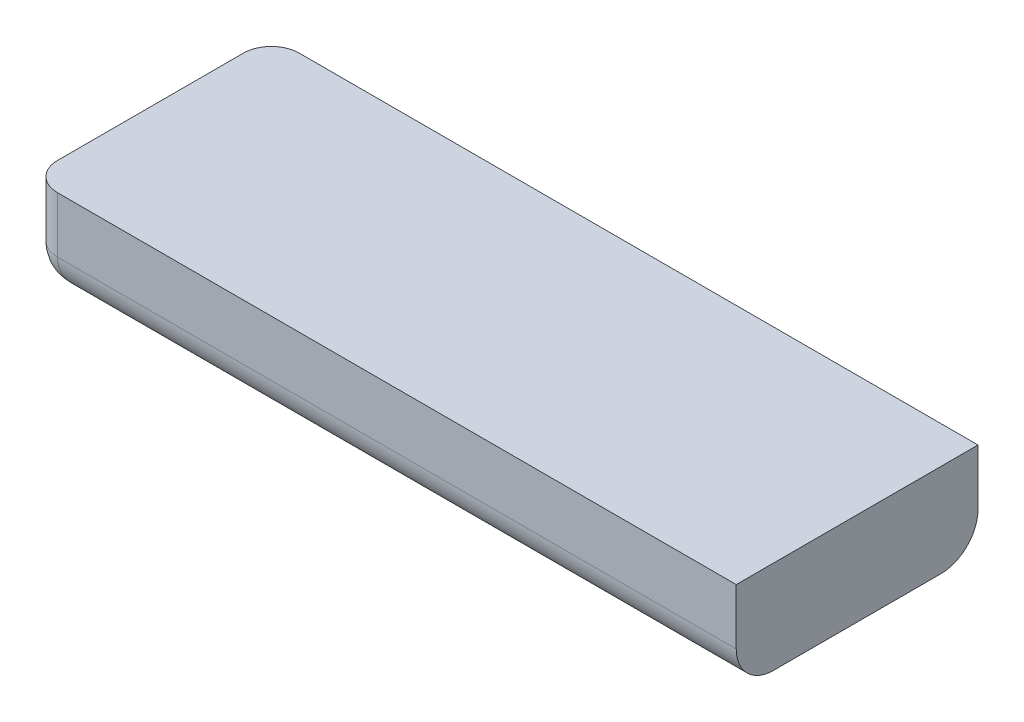
ISO-10303-21;
HEADER;
FILE_DESCRIPTION(('STEP AP214'),'2;1');
FILE_NAME('part.step','',(''),(''),'','','');
FILE_SCHEMA(('AUTOMOTIVE_DESIGN { 1 0 10303 214 1 1 1 1 }'));
ENDSEC;
DATA;
#1=APPLICATION_CONTEXT('core data for automotive mechanical design processes');
#2=APPLICATION_PROTOCOL_DEFINITION('international standard','automotive_design',2000,#1);
#3=PRODUCT_CONTEXT('',#1,'mechanical');
#4=PRODUCT('Part','Part','',(#3));
#5=PRODUCT_RELATED_PRODUCT_CATEGORY('part','',(#4));
#6=PRODUCT_DEFINITION_FORMATION('','',#4);
#7=PRODUCT_DEFINITION_CONTEXT('part definition',#1,'design');
#8=PRODUCT_DEFINITION('design','',#6,#7);
#9=PRODUCT_DEFINITION_SHAPE('','',#8);
#10=(LENGTH_UNIT() NAMED_UNIT(*) SI_UNIT(.MILLI.,.METRE.));
#11=(NAMED_UNIT(*) PLANE_ANGLE_UNIT() SI_UNIT($,.RADIAN.));
#12=(NAMED_UNIT(*) SI_UNIT($,.STERADIAN.) SOLID_ANGLE_UNIT());
#13=UNCERTAINTY_MEASURE_WITH_UNIT(LENGTH_MEASURE(1.E-05),#10,'distance_accuracy_value','');
#14=(GEOMETRIC_REPRESENTATION_CONTEXT(3) GLOBAL_UNCERTAINTY_ASSIGNED_CONTEXT((#13)) GLOBAL_UNIT_ASSIGNED_CONTEXT((#10,
#11,#12)) REPRESENTATION_CONTEXT('',''));
#15=CARTESIAN_POINT('',(0.,0.,0.));
#16=DIRECTION('',(0.,0.,1.));
#17=DIRECTION('',(1.,0.,0.));
#18=AXIS2_PLACEMENT_3D('',#15,#16,#17);
#19=CARTESIAN_POINT('',(-48.,0.,13.));
#20=DIRECTION('',(1.,0.,0.));
#21=DIRECTION('',(0.,0.,-1.));
#22=AXIS2_PLACEMENT_3D('',#19,#20,#21);
#23=PLANE('',#22);
#24=DIRECTION('',(0.,-1.,0.));
#25=VECTOR('',#24,1.);
#26=CARTESIAN_POINT('',(-48.,0.,1.5));
#27=LINE('',#26,#25);
#28=CARTESIAN_POINT('',(-48.,5.,1.5));
#29=VERTEX_POINT('',#28);
#30=CARTESIAN_POINT('',(-48.,2.,1.5));
#31=VERTEX_POINT('',#30);
#32=EDGE_CURVE('E143',#29,#31,#27,.T.);
#33=ORIENTED_EDGE('',*,*,#32,.T.);
#34=DIRECTION('',(0.,0.,-1.));
#35=VECTOR('',#34,1.);
#36=CARTESIAN_POINT('',(-48.,2.,13.));
#37=LINE('',#36,#35);
#38=CARTESIAN_POINT('',(-48.,2.,11.5));
#39=VERTEX_POINT('',#38);
#40=EDGE_CURVE('E11',#31,#39,#37,.F.);
#41=ORIENTED_EDGE('',*,*,#40,.T.);
#42=DIRECTION('',(0.,-1.,0.));
#43=VECTOR('',#42,1.);
#44=CARTESIAN_POINT('',(-48.,0.,11.5));
#45=LINE('',#44,#43);
#46=CARTESIAN_POINT('',(-48.,5.,11.5));
#47=VERTEX_POINT('',#46);
#48=EDGE_CURVE('E141',#39,#47,#45,.F.);
#49=ORIENTED_EDGE('',*,*,#48,.T.);
#50=DIRECTION('',(0.,0.,-1.));
#51=VECTOR('',#50,1.);
#52=CARTESIAN_POINT('',(-48.,5.,13.));
#53=LINE('',#52,#51);
#54=EDGE_CURVE('E126',#47,#29,#53,.T.);
#55=ORIENTED_EDGE('',*,*,#54,.T.);
#56=EDGE_LOOP('',(#33,#41,#49,#55));
#57=FACE_BOUND('',#56,.T.);
#58=ADVANCED_FACE('F37',(#57),#23,.F.);
#59=CARTESIAN_POINT('',(-48.,0.,13.));
#60=DIRECTION('',(0.,1.,0.));
#61=DIRECTION('',(0.,0.,1.));
#62=AXIS2_PLACEMENT_3D('',#59,#60,#61);
#63=PLANE('',#62);
#64=DIRECTION('',(0.,0.,-1.));
#65=VECTOR('',#64,1.);
#66=CARTESIAN_POINT('',(-10.,0.,13.));
#67=LINE('',#66,#65);
#68=CARTESIAN_POINT('',(-10.,0.,11.));
#69=VERTEX_POINT('',#68);
#70=CARTESIAN_POINT('',(-10.,0.,2.));
#71=VERTEX_POINT('',#70);
#72=EDGE_CURVE('E125',#69,#71,#67,.T.);
#73=ORIENTED_EDGE('',*,*,#72,.F.);
#74=DIRECTION('',(1.,0.,0.));
#75=VECTOR('',#74,1.);
#76=CARTESIAN_POINT('',(-48.,0.,11.));
#77=LINE('',#76,#75);
#78=CARTESIAN_POINT('',(-46.,0.,11.));
#79=VERTEX_POINT('',#78);
#80=EDGE_CURVE('E161',#69,#79,#77,.F.);
#81=ORIENTED_EDGE('',*,*,#80,.T.);
#82=DIRECTION('',(0.,0.,-1.));
#83=VECTOR('',#82,1.);
#84=CARTESIAN_POINT('',(-46.,0.,13.));
#85=LINE('',#84,#83);
#86=CARTESIAN_POINT('',(-46.,0.,2.));
#87=VERTEX_POINT('',#86);
#88=EDGE_CURVE('E157',#79,#87,#85,.T.);
#89=ORIENTED_EDGE('',*,*,#88,.T.);
#90=DIRECTION('',(1.,0.,0.));
#91=VECTOR('',#90,1.);
#92=CARTESIAN_POINT('',(-9.99999999999999,0.,2.));
#93=LINE('',#92,#91);
#94=EDGE_CURVE('E159',#87,#71,#93,.T.);
#95=ORIENTED_EDGE('',*,*,#94,.T.);
#96=EDGE_LOOP('',(#73,#81,#89,#95));
#97=FACE_BOUND('',#96,.T.);
#98=ADVANCED_FACE('F203',(#97),#63,.F.);
#99=CARTESIAN_POINT('',(-10.,0.,13.));
#100=DIRECTION('',(-1.,0.,0.));
#101=DIRECTION('',(0.,0.,1.));
#102=AXIS2_PLACEMENT_3D('',#99,#100,#101);
#103=PLANE('',#102);
#104=DIRECTION('',(0.,1.,0.));
#105=VECTOR('',#104,1.);
#106=CARTESIAN_POINT('',(-10.,0.,13.));
#107=LINE('',#106,#105);
#108=CARTESIAN_POINT('',(-10.,2.,13.));
#109=VERTEX_POINT('',#108);
#110=CARTESIAN_POINT('',(-10.,5.,13.));
#111=VERTEX_POINT('',#110);
#112=EDGE_CURVE('E106',#109,#111,#107,.T.);
#113=ORIENTED_EDGE('',*,*,#112,.F.);
#114=CARTESIAN_POINT('',(-10.,2.,11.));
#115=DIRECTION('',(-1.,0.,0.));
#116=DIRECTION('',(0.,0.,1.));
#117=AXIS2_PLACEMENT_3D('',#114,#115,#116);
#118=CIRCLE('',#117,2.);
#119=EDGE_CURVE('E155',#109,#69,#118,.F.);
#120=ORIENTED_EDGE('',*,*,#119,.T.);
#121=ORIENTED_EDGE('',*,*,#72,.T.);
#122=CARTESIAN_POINT('',(-9.99999999999999,2.,2.));
#123=DIRECTION('',(-1.,0.,0.));
#124=DIRECTION('',(0.,0.,1.));
#125=AXIS2_PLACEMENT_3D('',#122,#123,#124);
#126=CIRCLE('',#125,2.);
#127=CARTESIAN_POINT('',(-10.,2.,0.));
#128=VERTEX_POINT('',#127);
#129=EDGE_CURVE('E153',#71,#128,#126,.F.);
#130=ORIENTED_EDGE('',*,*,#129,.T.);
#131=DIRECTION('',(0.,1.,0.));
#132=VECTOR('',#131,1.);
#133=CARTESIAN_POINT('',(-10.,0.,0.));
#134=LINE('',#133,#132);
#135=CARTESIAN_POINT('',(-10.,5.,0.));
#136=VERTEX_POINT('',#135);
#137=EDGE_CURVE('E121',#128,#136,#134,.T.);
#138=ORIENTED_EDGE('',*,*,#137,.T.);
#139=DIRECTION('',(0.,0.,-1.));
#140=VECTOR('',#139,1.);
#141=CARTESIAN_POINT('',(-10.,5.,13.));
#142=LINE('',#141,#140);
#143=EDGE_CURVE('E119',#111,#136,#142,.T.);
#144=ORIENTED_EDGE('',*,*,#143,.F.);
#145=EDGE_LOOP('',(#113,#120,#121,#130,#138,#144));
#146=FACE_BOUND('',#145,.T.);
#147=ADVANCED_FACE('F120',(#146),#103,.F.);
#148=CARTESIAN_POINT('',(-48.,5.,13.));
#149=DIRECTION('',(0.,-1.,0.));
#150=DIRECTION('',(0.,0.,-1.));
#151=AXIS2_PLACEMENT_3D('',#148,#149,#150);
#152=PLANE('',#151);
#153=DIRECTION('',(-1.,0.,0.));
#154=VECTOR('',#153,1.);
#155=CARTESIAN_POINT('',(-48.,5.,0.));
#156=LINE('',#155,#154);
#157=CARTESIAN_POINT('',(-46.5,5.,0.));
#158=VERTEX_POINT('',#157);
#159=EDGE_CURVE('E116',#136,#158,#156,.T.);
#160=ORIENTED_EDGE('',*,*,#159,.T.);
#161=CARTESIAN_POINT('',(-46.5,5.,1.5));
#162=DIRECTION('',(0.,-1.,0.));
#163=DIRECTION('',(0.,0.,-1.));
#164=AXIS2_PLACEMENT_3D('',#161,#162,#163);
#165=CIRCLE('',#164,1.5);
#166=EDGE_CURVE('E148',#158,#29,#165,.F.);
#167=ORIENTED_EDGE('',*,*,#166,.T.);
#168=ORIENTED_EDGE('',*,*,#54,.F.);
#169=CARTESIAN_POINT('',(-46.5,5.,11.5));
#170=DIRECTION('',(0.,-1.,0.));
#171=DIRECTION('',(0.,0.,-1.));
#172=AXIS2_PLACEMENT_3D('',#169,#170,#171);
#173=CIRCLE('',#172,1.5);
#174=CARTESIAN_POINT('',(-46.5,5.,13.));
#175=VERTEX_POINT('',#174);
#176=EDGE_CURVE('E131',#47,#175,#173,.F.);
#177=ORIENTED_EDGE('',*,*,#176,.T.);
#178=DIRECTION('',(-1.,0.,0.));
#179=VECTOR('',#178,1.);
#180=CARTESIAN_POINT('',(-48.,5.,13.));
#181=LINE('',#180,#179);
#182=EDGE_CURVE('E111',#111,#175,#181,.T.);
#183=ORIENTED_EDGE('',*,*,#182,.F.);
#184=ORIENTED_EDGE('',*,*,#143,.T.);
#185=EDGE_LOOP('',(#160,#167,#168,#177,#183,#184));
#186=FACE_BOUND('',#185,.T.);
#187=ADVANCED_FACE('F128',(#186),#152,.F.);
#188=CARTESIAN_POINT('',(0.,0.,13.));
#189=DIRECTION('',(0.,0.,-1.));
#190=DIRECTION('',(-1.,0.,0.));
#191=AXIS2_PLACEMENT_3D('',#188,#189,#190);
#192=PLANE('',#191);
#193=DIRECTION('',(0.,-1.,0.));
#194=VECTOR('',#193,1.);
#195=CARTESIAN_POINT('',(-46.5,0.,13.));
#196=LINE('',#195,#194);
#197=CARTESIAN_POINT('',(-46.5,2.,13.));
#198=VERTEX_POINT('',#197);
#199=EDGE_CURVE('E150',#175,#198,#196,.T.);
#200=ORIENTED_EDGE('',*,*,#199,.T.);
#201=DIRECTION('',(1.,0.,0.));
#202=VECTOR('',#201,1.);
#203=CARTESIAN_POINT('',(0.,2.,13.));
#204=LINE('',#203,#202);
#205=EDGE_CURVE('E114',#198,#109,#204,.T.);
#206=ORIENTED_EDGE('',*,*,#205,.T.);
#207=ORIENTED_EDGE('',*,*,#112,.T.);
#208=ORIENTED_EDGE('',*,*,#182,.T.);
#209=EDGE_LOOP('',(#200,#206,#207,#208));
#210=FACE_BOUND('',#209,.T.);
#211=ADVANCED_FACE('F109',(#210),#192,.F.);
#212=CARTESIAN_POINT('',(0.,0.,0.));
#213=DIRECTION('',(0.,0.,-1.));
#214=DIRECTION('',(-1.,0.,0.));
#215=AXIS2_PLACEMENT_3D('',#212,#213,#214);
#216=PLANE('',#215);
#217=ORIENTED_EDGE('',*,*,#137,.F.);
#218=DIRECTION('',(1.,0.,0.));
#219=VECTOR('',#218,1.);
#220=CARTESIAN_POINT('',(-46.5,2.,0.));
#221=LINE('',#220,#219);
#222=CARTESIAN_POINT('',(-46.5,2.,0.));
#223=VERTEX_POINT('',#222);
#224=EDGE_CURVE('E62',#128,#223,#221,.F.);
#225=ORIENTED_EDGE('',*,*,#224,.T.);
#226=DIRECTION('',(0.,-1.,0.));
#227=VECTOR('',#226,1.);
#228=CARTESIAN_POINT('',(-46.5,5.,0.));
#229=LINE('',#228,#227);
#230=EDGE_CURVE('E145',#223,#158,#229,.F.);
#231=ORIENTED_EDGE('',*,*,#230,.T.);
#232=ORIENTED_EDGE('',*,*,#159,.F.);
#233=EDGE_LOOP('',(#217,#225,#231,#232));
#234=FACE_BOUND('',#233,.T.);
#235=ADVANCED_FACE('F215',(#234),#216,.T.);
#236=CARTESIAN_POINT('',(-46.5,0.,1.5));
#237=DIRECTION('',(0.,1.,0.));
#238=DIRECTION('',(0.,0.,1.));
#239=AXIS2_PLACEMENT_3D('',#236,#237,#238);
#240=CYLINDRICAL_SURFACE('',#239,1.5);
#241=ORIENTED_EDGE('',*,*,#230,.F.);
#242=CARTESIAN_POINT('',(-46.5,2.,1.5));
#243=DIRECTION('',(0.,1.,0.));
#244=DIRECTION('',(0.,0.,1.));
#245=AXIS2_PLACEMENT_3D('',#242,#243,#244);
#246=CIRCLE('',#245,1.5);
#247=EDGE_CURVE('E47',#223,#31,#246,.T.);
#248=ORIENTED_EDGE('',*,*,#247,.T.);
#249=ORIENTED_EDGE('',*,*,#32,.F.);
#250=ORIENTED_EDGE('',*,*,#166,.F.);
#251=EDGE_LOOP('',(#241,#248,#249,#250));
#252=FACE_BOUND('',#251,.T.);
#253=ADVANCED_FACE('F213',(#252),#240,.T.);
#254=CARTESIAN_POINT('',(-46.5,0.,11.5));
#255=DIRECTION('',(0.,-1.,0.));
#256=DIRECTION('',(0.,0.,-1.));
#257=AXIS2_PLACEMENT_3D('',#254,#255,#256);
#258=CYLINDRICAL_SURFACE('',#257,1.5);
#259=ORIENTED_EDGE('',*,*,#48,.F.);
#260=CARTESIAN_POINT('',(-46.5,2.,11.5));
#261=DIRECTION('',(0.,1.,0.));
#262=DIRECTION('',(0.,0.,1.));
#263=AXIS2_PLACEMENT_3D('',#260,#261,#262);
#264=CIRCLE('',#263,1.5);
#265=EDGE_CURVE('E163',#39,#198,#264,.T.);
#266=ORIENTED_EDGE('',*,*,#265,.T.);
#267=ORIENTED_EDGE('',*,*,#199,.F.);
#268=ORIENTED_EDGE('',*,*,#176,.F.);
#269=EDGE_LOOP('',(#259,#266,#267,#268));
#270=FACE_BOUND('',#269,.T.);
#271=ADVANCED_FACE('F200',(#270),#258,.T.);
#272=CARTESIAN_POINT('',(-48.,2.,2.));
#273=DIRECTION('',(-1.,0.,0.));
#274=DIRECTION('',(0.,0.,1.));
#275=AXIS2_PLACEMENT_3D('',#272,#273,#274);
#276=CYLINDRICAL_SURFACE('',#275,2.);
#277=ORIENTED_EDGE('',*,*,#129,.F.);
#278=ORIENTED_EDGE('',*,*,#94,.F.);
#279=CARTESIAN_POINT('',(-46.,2.,2.));
#280=DIRECTION('',(0.970142500145332,0.,-0.242535625036333));
#281=DIRECTION('',(-0.242535625036333,0.,-0.970142500145332));
#282=AXIS2_PLACEMENT_3D('',#279,#280,#281);
#283=ELLIPSE('',#282,2.06155281280883,2.);
#284=EDGE_CURVE('E137',#223,#87,#283,.F.);
#285=ORIENTED_EDGE('',*,*,#284,.F.);
#286=ORIENTED_EDGE('',*,*,#224,.F.);
#287=EDGE_LOOP('',(#277,#278,#285,#286));
#288=FACE_BOUND('',#287,.T.);
#289=ADVANCED_FACE('F39',(#288),#276,.T.);
#290=CARTESIAN_POINT('',(-46.,4.,2.));
#291=CARTESIAN_POINT('',(-46.,4.,2.));
#292=CARTESIAN_POINT('',(-46.,4.,2.));
#293=CARTESIAN_POINT('',(-46.0217823735519,3.99996494474998,1.9128705057924));
#294=CARTESIAN_POINT('',(-46.0544658990014,3.99993095316826,1.9455341009986));
#295=CARTESIAN_POINT('',(-46.0871294942076,3.99996494474999,1.9782176264481));
#296=CARTESIAN_POINT('',(-46.0435703088954,3.99430351256916,1.82571876441834));
#297=CARTESIAN_POINT('',(-46.1090831888134,3.99856983476416,1.89091681118662));
#298=CARTESIAN_POINT('',(-46.1742812355816,3.99430351256916,1.95642969110459));
#299=CARTESIAN_POINT('',(-46.0867714969681,3.9715729489111,1.65291401212763));
#300=CARTESIAN_POINT('',(-46.2187583926554,3.99277254732977,1.78124160734456));
#301=CARTESIAN_POINT('',(-46.3470859878724,3.9715729489111,1.91322850303191));
#302=CARTESIAN_POINT('',(-46.1081863603207,3.95460119067819,1.56725455871726));
#303=CARTESIAN_POINT('',(-46.274125241757,3.98832872132925,1.72587475824302));
#304=CARTESIAN_POINT('',(-46.4327454412828,3.95460119067819,1.89181363967932));
#305=CARTESIAN_POINT('',(-46.1502767096491,3.90948369144371,1.39889316140363));
#306=CARTESIAN_POINT('',(-46.3860602594996,3.97583045239163,1.61393974050036));
#307=CARTESIAN_POINT('',(-46.6011068385964,3.90948369144371,1.84972329035091));
#308=CARTESIAN_POINT('',(-46.1709585724816,3.88153014584449,1.31616571007354));
#309=CARTESIAN_POINT('',(-46.4429333103374,3.96776150811199,1.55706668966255));
#310=CARTESIAN_POINT('',(-46.6838342899265,3.88153014584449,1.82904142751839));
#311=CARTESIAN_POINT('',(-46.2112227334933,3.81481991430687,1.15510906602663));
#312=CARTESIAN_POINT('',(-46.5586469433439,3.94682689780725,1.4413530566561));
#313=CARTESIAN_POINT('',(-46.8448909339734,3.81481991430687,1.78877726650666));
#314=CARTESIAN_POINT('',(-46.2308195679233,3.77634632088565,1.07672172830669));
#315=CARTESIAN_POINT('',(-46.6177814364256,3.93394473948205,1.38221856357442));
#316=CARTESIAN_POINT('',(-46.9232782716933,3.77634632088565,1.76918043207667));
#317=CARTESIAN_POINT('',(-46.26856991767,3.68916522333628,0.925720329320102));
#318=CARTESIAN_POINT('',(-46.7387097314489,3.90148554453111,1.26129026855111));
#319=CARTESIAN_POINT('',(-47.0742796706799,3.68916522333628,1.73143008233003));
#320=CARTESIAN_POINT('',(-46.2867495193356,3.64082244489378,0.85300192265774));
#321=CARTESIAN_POINT('',(-46.8007763341728,3.88189914028463,1.19922366582722));
#322=CARTESIAN_POINT('',(-47.1469980773423,3.64082244489378,1.71325048066444));
#323=CARTESIAN_POINT('',(-46.3213420383227,3.53464696521005,0.714631846709061));
#324=CARTESIAN_POINT('',(-46.9279910465151,3.83314574012919,1.07200895348487));
#325=CARTESIAN_POINT('',(-47.2853681532909,3.53464696521006,1.67865796167727));
#326=CARTESIAN_POINT('',(-46.3377958358128,3.47724460284421,0.648816656748729));
#327=CARTESIAN_POINT('',(-46.9933740400537,3.80399573458142,1.00662595994632));
#328=CARTESIAN_POINT('',(-47.3511833432513,3.47724460284421,1.66220416418718));
#329=CARTESIAN_POINT('',(-46.3686396401377,3.35386777783721,0.525441439449086));
#330=CARTESIAN_POINT('',(-47.12698019571,3.73205835147552,0.87301980429005));
#331=CARTESIAN_POINT('',(-47.4745585605509,3.35386777783721,1.63136035986227));
#332=CARTESIAN_POINT('',(-46.383087706164,3.28836268671713,0.46764917534402));
#333=CARTESIAN_POINT('',(-47.1953761618153,3.68935068106379,0.804623838184725));
#334=CARTESIAN_POINT('',(-47.532350824656,3.28836268671713,1.61691229383601));
#335=CARTESIAN_POINT('',(-46.4096548366656,3.14986714163205,0.36138065333758));
#336=CARTESIAN_POINT('',(-47.3334466924501,3.58516450268843,0.666553307549958));
#337=CARTESIAN_POINT('',(-47.6386193466624,3.14986714163204,1.5903451633344));
#338=CARTESIAN_POINT('',(-46.4218493954006,3.07734548187638,0.312602418397777));
#339=CARTESIAN_POINT('',(-47.4032025242226,3.52389206574663,0.596797475777379));
#340=CARTESIAN_POINT('',(-47.6873975816022,3.07734548187638,1.57815060459944));
#341=CARTESIAN_POINT('',(-46.4436829907165,2.92607041368136,0.225268037133861));
#342=CARTESIAN_POINT('',(-47.5402611598715,3.37720248612513,0.459738840128498));
#343=CARTESIAN_POINT('',(-47.7747319628661,2.92607041368136,1.55631700928347));
#344=CARTESIAN_POINT('',(-46.4534111045777,2.84773367629154,0.186355581689056));
#345=CARTESIAN_POINT('',(-47.6075290720318,3.29221621118452,0.392470927968151));
#346=CARTESIAN_POINT('',(-47.8136444183109,2.84773367629154,1.54658889542226));
#347=CARTESIAN_POINT('',(-46.4701326318778,2.68624305324206,0.119469472488753));
#348=CARTESIAN_POINT('',(-47.7331106365313,3.09457190601744,0.266889363468725));
#349=CARTESIAN_POINT('',(-47.8805305275112,2.68624305324206,1.52986736812219));
#350=CARTESIAN_POINT('',(-46.4772186371533,2.60340026957908,0.0911254513869064));
#351=CARTESIAN_POINT('',(-47.7912758499544,2.98269208037831,0.208724150045587));
#352=CARTESIAN_POINT('',(-47.9088745486131,2.60340026957908,1.52278136284673));
#353=CARTESIAN_POINT('',(-46.4885347087233,2.43445104755719,0.0458611651065924));
#354=CARTESIAN_POINT('',(-47.8900061070333,2.73279669472578,0.109993892966676));
#355=CARTESIAN_POINT('',(-47.9541388348934,2.43445104755719,1.51146529127665));
#356=CARTESIAN_POINT('',(-46.492844140155,2.34851729547956,0.0286234393801281));
#357=CARTESIAN_POINT('',(-47.9303663463236,2.59599834502849,0.0696336536764172));
#358=CARTESIAN_POINT('',(-47.9713765606199,2.34851729547956,1.50715585984503));
#359=CARTESIAN_POINT('',(-46.4985534982464,2.1750224755448,0.00578600701445321));
#360=CARTESIAN_POINT('',(-47.9854388494596,2.30535282110524,0.0145611505404173));
#361=CARTESIAN_POINT('',(-47.9942139929856,2.1750224755448,1.50144650175361));
#362=CARTESIAN_POINT('',(-46.5,2.0875112377724,0.));
#363=CARTESIAN_POINT('',(-48.,2.15312193493139,0.));
#364=CARTESIAN_POINT('',(-48.,2.0875112377724,1.5));
#365=CARTESIAN_POINT('',(-46.5,1.9124887622276,0.));
#366=CARTESIAN_POINT('',(-48.,1.84687806506861,0.));
#367=CARTESIAN_POINT('',(-48.,1.9124887622276,1.5));
#368=CARTESIAN_POINT('',(-46.4985534982464,1.82497752445519,0.0057860070144531));
#369=CARTESIAN_POINT('',(-47.9854388494596,1.69464717889476,0.0145611505404174));
#370=CARTESIAN_POINT('',(-47.9942139929856,1.82497752445519,1.50144650175361));
#371=CARTESIAN_POINT('',(-46.492844140155,1.65148270452044,0.028623439380128));
#372=CARTESIAN_POINT('',(-47.9303663463236,1.40400165497151,0.0696336536764171));
#373=CARTESIAN_POINT('',(-47.9713765606199,1.65148270452044,1.50715585984503));
#374=CARTESIAN_POINT('',(-46.4885347087233,1.56554895244281,0.0458611651065922));
#375=CARTESIAN_POINT('',(-47.8900061070333,1.26720330527422,0.109993892966675));
#376=CARTESIAN_POINT('',(-47.9541388348934,1.56554895244281,1.51146529127665));
#377=CARTESIAN_POINT('',(-46.4772186371533,1.39659973042092,0.0911254513869063));
#378=CARTESIAN_POINT('',(-47.7912758499544,1.01730791962169,0.208724150045585));
#379=CARTESIAN_POINT('',(-47.9088745486131,1.39659973042092,1.52278136284673));
#380=CARTESIAN_POINT('',(-46.4701326318778,1.31375694675793,0.119469472488754));
#381=CARTESIAN_POINT('',(-47.7331106365313,0.905428093982555,0.266889363468725));
#382=CARTESIAN_POINT('',(-47.8805305275112,1.31375694675793,1.52986736812219));
#383=CARTESIAN_POINT('',(-46.4534111045777,1.15226632370846,0.186355581689057));
#384=CARTESIAN_POINT('',(-47.6075290720318,0.707783788815476,0.392470927968151));
#385=CARTESIAN_POINT('',(-47.8136444183109,1.15226632370846,1.54658889542226));
#386=CARTESIAN_POINT('',(-46.4436829907165,1.07392958631864,0.225268037133861));
#387=CARTESIAN_POINT('',(-47.5402611598715,0.622797513874873,0.459738840128498));
#388=CARTESIAN_POINT('',(-47.7747319628661,1.07392958631864,1.55631700928347));
#389=CARTESIAN_POINT('',(-46.4218493954006,0.922654518123616,0.312602418397776));
#390=CARTESIAN_POINT('',(-47.4032025242226,0.476107934253368,0.596797475777378));
#391=CARTESIAN_POINT('',(-47.6873975816022,0.92265451812362,1.57815060459944));
#392=CARTESIAN_POINT('',(-46.4096548366656,0.850132858367954,0.361380653337579));
#393=CARTESIAN_POINT('',(-47.33344669245,0.414835497311566,0.666553307549957));
#394=CARTESIAN_POINT('',(-47.6386193466624,0.850132858367957,1.59034516333439));
#395=CARTESIAN_POINT('',(-46.383087706164,0.711637313282867,0.467649175344019));
#396=CARTESIAN_POINT('',(-47.1953761618153,0.310649318936207,0.804623838184724));
#397=CARTESIAN_POINT('',(-47.532350824656,0.711637313282866,1.616912293836));
#398=CARTESIAN_POINT('',(-46.3686396401377,0.646132222162793,0.525441439449085));
#399=CARTESIAN_POINT('',(-47.1269801957099,0.267941648524485,0.873019804290049));
#400=CARTESIAN_POINT('',(-47.4745585605509,0.646132222162791,1.63136035986227));
#401=CARTESIAN_POINT('',(-46.3377958358128,0.522755397155792,0.648816656748728));
#402=CARTESIAN_POINT('',(-46.9933740400537,0.196004265418576,1.00662595994632));
#403=CARTESIAN_POINT('',(-47.3511833432513,0.522755397155788,1.66220416418718));
#404=CARTESIAN_POINT('',(-46.3213420383227,0.465353034789947,0.71463184670906));
#405=CARTESIAN_POINT('',(-46.9279910465151,0.166854259870814,1.07200895348487));
#406=CARTESIAN_POINT('',(-47.2853681532909,0.465353034789942,1.67865796167726));
#407=CARTESIAN_POINT('',(-46.2867495193356,0.359177555106218,0.853001922657739));
#408=CARTESIAN_POINT('',(-46.8007763341728,0.11810085971537,1.19922366582722));
#409=CARTESIAN_POINT('',(-47.1469980773423,0.359177555106215,1.71325048066443));
#410=CARTESIAN_POINT('',(-46.26856991767,0.310834776663722,0.925720329320102));
#411=CARTESIAN_POINT('',(-46.7387097314489,0.0985144554688906,1.26129026855111));
#412=CARTESIAN_POINT('',(-47.0742796706799,0.310834776663723,1.73143008233003));
#413=CARTESIAN_POINT('',(-46.2308195679233,0.223653679114346,1.07672172830669));
#414=CARTESIAN_POINT('',(-46.6177814364256,0.0660552605179474,1.38221856357442));
#415=CARTESIAN_POINT('',(-46.9232782716933,0.223653679114346,1.76918043207667));
#416=CARTESIAN_POINT('',(-46.2112227334933,0.185180085693135,1.15510906602663));
#417=CARTESIAN_POINT('',(-46.5586469433439,0.0531731021927445,1.4413530566561));
#418=CARTESIAN_POINT('',(-46.8448909339734,0.18518008569313,1.78877726650666));
#419=CARTESIAN_POINT('',(-46.1709585724816,0.11846985415551,1.31616571007354));
#420=CARTESIAN_POINT('',(-46.4429333103374,0.0322384918880124,1.55706668966255));
#421=CARTESIAN_POINT('',(-46.6838342899265,0.118469854155506,1.82904142751839));
#422=CARTESIAN_POINT('',(-46.1502767096491,0.0905163085562906,1.39889316140363));
#423=CARTESIAN_POINT('',(-46.3860602594996,0.0241695476083737,1.61393974050036));
#424=CARTESIAN_POINT('',(-46.6011068385964,0.090516308556292,1.84972329035091));
#425=CARTESIAN_POINT('',(-46.1081863603207,0.0453988093218062,1.56725455871726));
#426=CARTESIAN_POINT('',(-46.274125241757,0.0116712786707473,1.72587475824302));
#427=CARTESIAN_POINT('',(-46.4327454412828,0.0453988093218109,1.89181363967932));
#428=CARTESIAN_POINT('',(-46.0867714969681,0.0284270510888973,1.65291401212763));
#429=CARTESIAN_POINT('',(-46.2187583926554,0.00722745267022655,1.78124160734456));
#430=CARTESIAN_POINT('',(-46.3470859878724,0.0284270510888994,1.91322850303191));
#431=CARTESIAN_POINT('',(-46.0435703088954,0.00569648743083564,1.82571876441834));
#432=CARTESIAN_POINT('',(-46.1090831888134,0.00143016523584192,1.89091681118662));
#433=CARTESIAN_POINT('',(-46.1742812355816,0.00569648743083349,1.95642969110458));
#434=CARTESIAN_POINT('',(-46.0217823735519,3.50552500160527E-05,1.9128705057924));
#435=CARTESIAN_POINT('',(-46.0544658990014,6.90468317338841E-05,1.9455341009986));
#436=CARTESIAN_POINT('',(-46.0871294942076,3.50552500122641E-05,1.9782176264481));
#437=CARTESIAN_POINT('',(-46.,0.,2.));
#438=CARTESIAN_POINT('',(-46.,0.,2.));
#439=CARTESIAN_POINT('',(-46.,0.,2.));
#440=(BOUNDED_SURFACE() B_SPLINE_SURFACE(3,2,((#290,#291,#292),(#293,#294,#295),(#296,#297,
#298),(#299,#300,#301),(#302,#303,#304),(#305,#306,#307),(#308,#309,#310),(#311,#312,#313),
(#314,#315,#316),(#317,#318,#319),(#320,#321,#322),(#323,#324,#325),(#326,#327,#328),(#329,#330,
#331),(#332,#333,#334),(#335,#336,#337),(#338,#339,#340),(#341,#342,#343),(#344,#345,#346),
(#347,#348,#349),(#350,#351,#352),(#353,#354,#355),(#356,#357,#358),(#359,#360,#361),(#362,#363,
#364),(#365,#366,#367),(#368,#369,#370),(#371,#372,#373),(#374,#375,#376),(#377,#378,#379),
(#380,#381,#382),(#383,#384,#385),(#386,#387,#388),(#389,#390,#391),(#392,#393,#394),(#395,#396,
#397),(#398,#399,#400),(#401,#402,#403),(#404,#405,#406),(#407,#408,#409),(#410,#411,#412),
(#413,#414,#415),(#416,#417,#418),(#419,#420,#421),(#422,#423,#424),(#425,#426,#427),(#428,#429,
#430),(#431,#432,#433),(#434,#435,#436),(#437,#438,#439)),.UNSPECIFIED.,.F.,.F.,
.F.) B_SPLINE_SURFACE_WITH_KNOTS((4,2,2,2,2,2,2,2,2,2,2,2,2,2,2,2,2,2,2,2,2,2,2,2,4),(3,3),(0.,
0.0923950270683505,0.184004706351033,0.274077820658671,0.361932038391825,0.446989850632085,
0.528816016293443,0.607156213845176,0.681975172112349,0.753489816527185,0.822188739504235,
0.888824875354154,0.954367738522642,1.01991060169113,1.08654673754105,1.1552456605181,
1.22676030493293,1.30157926320011,1.37991946075184,1.4617456264132,1.54680343865346,
1.63465765638661,1.72473077069425,1.81634044997693,1.90873547704528),(0.,1.),
.UNSPECIFIED.) GEOMETRIC_REPRESENTATION_ITEM() RATIONAL_B_SPLINE_SURFACE(((1.,1.,1.),(1.,
1.00000566557019,1.),(1.,0.998576699090688,1.),(1.,0.992910721279765,1.),(1.,0.988697681267574,
1.),(1.,0.977617128833049,1.),(1.,0.970795325018433,1.),(1.,0.954789124900482,1.),(1.,
0.945667069465631,1.),(1.,0.92548796875733,1.),(1.,0.914501756375307,1.),(1.,0.891169998194025,
1.),(1.,0.878891956959709,1.),(1.,0.853706993048538,1.),(1.,0.84084914596985,1.),(1.,
0.815387454422431,1.),(1.,0.802798170091792,1.),(1.,0.778880732263429,1.),(1.,0.767521437046521,
1.),(1.,0.747118526989835,1.),(1.,0.738001346912332,1.),(1.,0.723039691293395,1.),(1.,
0.717105167896984,1.),(1.,0.709170186451793,1.),(1.,0.707106781186548,1.),(1.,0.707106781186548,
1.),(1.,0.709170186451793,1.),(1.,0.717105167896984,1.),(1.,0.723039691293395,1.),(1.,
0.738001346912332,1.),(1.,0.747118526989835,1.),(1.,0.767521437046521,1.),(1.,0.778880732263429,
1.),(1.,0.802798170091791,1.),(1.,0.81538745442243,1.),(1.,0.84084914596985,1.),(1.,
0.853706993048538,1.),(1.,0.878891956959709,1.),(1.,0.891169998194025,1.),(1.,0.914501756375307,
1.),(1.,0.92548796875733,1.),(1.,0.945667069465631,1.),(1.,0.954789124900482,1.),(1.,
0.970795325018433,1.),(1.,0.977617128833049,1.),(1.,0.988697681267574,1.),(1.,0.992910721279765,
1.),(1.,0.998576699090688,1.),(1.,1.00000566557019,1.),(1.,1.,1.))) REPRESENTATION_ITEM('') SURFACE());
#441=ORIENTED_EDGE('',*,*,#247,.F.);
#442=ORIENTED_EDGE('',*,*,#284,.T.);
#443=CARTESIAN_POINT('',(-46.,2.,2.));
#444=DIRECTION('',(0.242535625036332,0.,-0.970142500145332));
#445=DIRECTION('',(-0.970142500145332,0.,-0.242535625036332));
#446=AXIS2_PLACEMENT_3D('',#443,#444,#445);
#447=ELLIPSE('',#446,2.06155281280883,2.);
#448=EDGE_CURVE('E173',#31,#87,#447,.F.);
#449=ORIENTED_EDGE('',*,*,#448,.F.);
#450=EDGE_LOOP('',(#441,#442,#449));
#451=FACE_BOUND('',#450,.T.);
#452=ADVANCED_FACE('F190',(#451),#440,.T.);
#453=CARTESIAN_POINT('',(-46.,2.,13.));
#454=DIRECTION('',(0.,0.,-1.));
#455=DIRECTION('',(-1.,0.,0.));
#456=AXIS2_PLACEMENT_3D('',#453,#454,#455);
#457=CYLINDRICAL_SURFACE('',#456,2.);
#458=ORIENTED_EDGE('',*,*,#448,.T.);
#459=ORIENTED_EDGE('',*,*,#88,.F.);
#460=CARTESIAN_POINT('',(-46.,2.,11.));
#461=DIRECTION('',(0.242535625036333,0.,0.970142500145332));
#462=DIRECTION('',(0.970142500145332,0.,-0.242535625036333));
#463=AXIS2_PLACEMENT_3D('',#460,#461,#462);
#464=ELLIPSE('',#463,2.06155281280883,2.);
#465=EDGE_CURVE('E170',#39,#79,#464,.T.);
#466=ORIENTED_EDGE('',*,*,#465,.F.);
#467=ORIENTED_EDGE('',*,*,#40,.F.);
#468=EDGE_LOOP('',(#458,#459,#466,#467));
#469=FACE_BOUND('',#468,.T.);
#470=ADVANCED_FACE('F184',(#469),#457,.T.);
#471=CARTESIAN_POINT('',(-46.,0.,11.));
#472=CARTESIAN_POINT('',(-46.,0.,11.));
#473=CARTESIAN_POINT('',(-46.,0.,11.));
#474=CARTESIAN_POINT('',(-46.0217823735519,3.50552500164636E-05,11.0871294942076));
#475=CARTESIAN_POINT('',(-46.0544658990014,6.90468317340297E-05,11.0544658990014));
#476=CARTESIAN_POINT('',(-46.0871294942076,3.5055250012104E-05,11.0217823735519));
#477=CARTESIAN_POINT('',(-46.0435703088954,0.0056964874308359,11.1742812355817));
#478=CARTESIAN_POINT('',(-46.1090831888134,0.00143016523584201,11.1090831888134));
#479=CARTESIAN_POINT('',(-46.1742812355816,0.0056964874308334,11.0435703088954));
#480=CARTESIAN_POINT('',(-46.0867714969681,0.028427051088897,11.3470859878724));
#481=CARTESIAN_POINT('',(-46.2187583926554,0.00722745267022646,11.2187583926554));
#482=CARTESIAN_POINT('',(-46.3470859878724,0.0284270510888995,11.0867714969681));
#483=CARTESIAN_POINT('',(-46.1081863603207,0.0453988093218055,11.4327454412827));
#484=CARTESIAN_POINT('',(-46.274125241757,0.0116712786707471,11.274125241757));
#485=CARTESIAN_POINT('',(-46.4327454412828,0.045398809321811,11.1081863603207));
#486=CARTESIAN_POINT('',(-46.1502767096491,0.0905163085562898,11.6011068385964));
#487=CARTESIAN_POINT('',(-46.3860602594996,0.0241695476083736,11.3860602594996));
#488=CARTESIAN_POINT('',(-46.6011068385964,0.090516308556292,11.1502767096491));
#489=CARTESIAN_POINT('',(-46.1709585724816,0.11846985415551,11.6838342899265));
#490=CARTESIAN_POINT('',(-46.4429333103374,0.0322384918880124,11.4429333103374));
#491=CARTESIAN_POINT('',(-46.6838342899265,0.118469854155506,11.1709585724816));
#492=CARTESIAN_POINT('',(-46.2112227334933,0.185180085693135,11.8448909339734));
#493=CARTESIAN_POINT('',(-46.5586469433439,0.0531731021927444,11.5586469433439));
#494=CARTESIAN_POINT('',(-46.8448909339734,0.185180085693129,11.2112227334933));
#495=CARTESIAN_POINT('',(-46.2308195679233,0.223653679114346,11.9232782716933));
#496=CARTESIAN_POINT('',(-46.6177814364256,0.066055260517947,11.6177814364256));
#497=CARTESIAN_POINT('',(-46.9232782716933,0.223653679114346,11.2308195679233));
#498=CARTESIAN_POINT('',(-46.26856991767,0.310834776663722,12.0742796706799));
#499=CARTESIAN_POINT('',(-46.7387097314489,0.0985144554688901,11.7387097314489));
#500=CARTESIAN_POINT('',(-47.0742796706799,0.310834776663723,11.26856991767));
#501=CARTESIAN_POINT('',(-46.2867495193356,0.359177555106217,12.1469980773423));
#502=CARTESIAN_POINT('',(-46.8007763341728,0.118100859715369,11.8007763341728));
#503=CARTESIAN_POINT('',(-47.1469980773423,0.359177555106215,11.2867495193356));
#504=CARTESIAN_POINT('',(-46.3213420383227,0.465353034789946,12.2853681532909));
#505=CARTESIAN_POINT('',(-46.9279910465151,0.166854259870814,11.9279910465151));
#506=CARTESIAN_POINT('',(-47.2853681532909,0.465353034789942,11.3213420383227));
#507=CARTESIAN_POINT('',(-46.3377958358128,0.522755397155793,12.3511833432513));
#508=CARTESIAN_POINT('',(-46.9933740400537,0.196004265418576,11.9933740400537));
#509=CARTESIAN_POINT('',(-47.3511833432513,0.522755397155788,11.3377958358128));
#510=CARTESIAN_POINT('',(-46.3686396401377,0.646132222162794,12.4745585605509));
#511=CARTESIAN_POINT('',(-47.1269801957099,0.267941648524484,12.12698019571));
#512=CARTESIAN_POINT('',(-47.4745585605509,0.646132222162791,11.3686396401377));
#513=CARTESIAN_POINT('',(-46.383087706164,0.711637313282868,12.532350824656));
#514=CARTESIAN_POINT('',(-47.1953761618153,0.310649318936207,12.1953761618153));
#515=CARTESIAN_POINT('',(-47.532350824656,0.711637313282866,11.383087706164));
#516=CARTESIAN_POINT('',(-46.4096548366656,0.850132858367955,12.6386193466624));
#517=CARTESIAN_POINT('',(-47.33344669245,0.414835497311566,12.33344669245));
#518=CARTESIAN_POINT('',(-47.6386193466624,0.850132858367956,11.4096548366656));
#519=CARTESIAN_POINT('',(-46.4218493954006,0.922654518123617,12.6873975816022));
#520=CARTESIAN_POINT('',(-47.4032025242226,0.476107934253369,12.4032025242226));
#521=CARTESIAN_POINT('',(-47.6873975816022,0.92265451812362,11.4218493954006));
#522=CARTESIAN_POINT('',(-46.4436829907165,1.07392958631864,12.7747319628661));
#523=CARTESIAN_POINT('',(-47.5402611598715,0.622797513874874,12.5402611598715));
#524=CARTESIAN_POINT('',(-47.7747319628661,1.07392958631864,11.4436829907165));
#525=CARTESIAN_POINT('',(-46.4534111045777,1.15226632370846,12.8136444183109));
#526=CARTESIAN_POINT('',(-47.6075290720318,0.707783788815477,12.6075290720319));
#527=CARTESIAN_POINT('',(-47.8136444183109,1.15226632370846,11.4534111045777));
#528=CARTESIAN_POINT('',(-46.4701326318778,1.31375694675793,12.8805305275112));
#529=CARTESIAN_POINT('',(-47.7331106365313,0.905428093982554,12.7331106365313));
#530=CARTESIAN_POINT('',(-47.8805305275112,1.31375694675793,11.4701326318778));
#531=CARTESIAN_POINT('',(-46.4772186371533,1.39659973042092,12.9088745486131));
#532=CARTESIAN_POINT('',(-47.7912758499544,1.01730791962169,12.7912758499544));
#533=CARTESIAN_POINT('',(-47.9088745486131,1.39659973042092,11.4772186371533));
#534=CARTESIAN_POINT('',(-46.4885347087233,1.56554895244281,12.9541388348934));
#535=CARTESIAN_POINT('',(-47.8900061070333,1.26720330527422,12.8900061070333));
#536=CARTESIAN_POINT('',(-47.9541388348934,1.56554895244281,11.4885347087233));
#537=CARTESIAN_POINT('',(-46.492844140155,1.65148270452044,12.9713765606199));
#538=CARTESIAN_POINT('',(-47.9303663463236,1.40400165497151,12.9303663463236));
#539=CARTESIAN_POINT('',(-47.9713765606199,1.65148270452044,11.492844140155));
#540=CARTESIAN_POINT('',(-46.4985534982464,1.82497752445519,12.9942139929855));
#541=CARTESIAN_POINT('',(-47.9854388494596,1.69464717889476,12.9854388494596));
#542=CARTESIAN_POINT('',(-47.9942139929856,1.82497752445519,11.4985534982464));
#543=CARTESIAN_POINT('',(-46.5,1.9124887622276,13.));
#544=CARTESIAN_POINT('',(-48.,1.84687806506861,13.));
#545=CARTESIAN_POINT('',(-48.,1.9124887622276,11.5));
#546=CARTESIAN_POINT('',(-46.5,2.0875112377724,13.));
#547=CARTESIAN_POINT('',(-48.,2.15312193493139,13.));
#548=CARTESIAN_POINT('',(-48.,2.0875112377724,11.5));
#549=CARTESIAN_POINT('',(-46.4985534982464,2.17502247554481,12.9942139929855));
#550=CARTESIAN_POINT('',(-47.9854388494596,2.30535282110524,12.9854388494596));
#551=CARTESIAN_POINT('',(-47.9942139929856,2.17502247554481,11.4985534982464));
#552=CARTESIAN_POINT('',(-46.492844140155,2.34851729547956,12.9713765606199));
#553=CARTESIAN_POINT('',(-47.9303663463236,2.59599834502849,12.9303663463236));
#554=CARTESIAN_POINT('',(-47.9713765606199,2.34851729547956,11.492844140155));
#555=CARTESIAN_POINT('',(-46.4885347087233,2.43445104755719,12.9541388348934));
#556=CARTESIAN_POINT('',(-47.8900061070333,2.73279669472578,12.8900061070333));
#557=CARTESIAN_POINT('',(-47.9541388348934,2.43445104755719,11.4885347087233));
#558=CARTESIAN_POINT('',(-46.4772186371533,2.60340026957908,12.9088745486131));
#559=CARTESIAN_POINT('',(-47.7912758499544,2.98269208037831,12.7912758499544));
#560=CARTESIAN_POINT('',(-47.9088745486131,2.60340026957908,11.4772186371533));
#561=CARTESIAN_POINT('',(-46.4701326318778,2.68624305324206,12.8805305275112));
#562=CARTESIAN_POINT('',(-47.7331106365313,3.09457190601745,12.7331106365313));
#563=CARTESIAN_POINT('',(-47.8805305275112,2.68624305324207,11.4701326318778));
#564=CARTESIAN_POINT('',(-46.4534111045777,2.84773367629154,12.8136444183109));
#565=CARTESIAN_POINT('',(-47.6075290720318,3.29221621118452,12.6075290720319));
#566=CARTESIAN_POINT('',(-47.8136444183109,2.84773367629154,11.4534111045777));
#567=CARTESIAN_POINT('',(-46.4436829907165,2.92607041368136,12.7747319628661));
#568=CARTESIAN_POINT('',(-47.5402611598715,3.37720248612513,12.5402611598715));
#569=CARTESIAN_POINT('',(-47.7747319628661,2.92607041368136,11.4436829907165));
#570=CARTESIAN_POINT('',(-46.4218493954006,3.07734548187638,12.6873975816022));
#571=CARTESIAN_POINT('',(-47.4032025242226,3.52389206574663,12.4032025242226));
#572=CARTESIAN_POINT('',(-47.6873975816022,3.07734548187638,11.4218493954006));
#573=CARTESIAN_POINT('',(-46.4096548366656,3.14986714163204,12.6386193466624));
#574=CARTESIAN_POINT('',(-47.33344669245,3.58516450268843,12.33344669245));
#575=CARTESIAN_POINT('',(-47.6386193466624,3.14986714163204,11.4096548366656));
#576=CARTESIAN_POINT('',(-46.383087706164,3.28836268671713,12.532350824656));
#577=CARTESIAN_POINT('',(-47.1953761618153,3.68935068106379,12.1953761618153));
#578=CARTESIAN_POINT('',(-47.532350824656,3.28836268671713,11.383087706164));
#579=CARTESIAN_POINT('',(-46.3686396401377,3.35386777783721,12.4745585605509));
#580=CARTESIAN_POINT('',(-47.1269801957099,3.73205835147551,12.12698019571));
#581=CARTESIAN_POINT('',(-47.4745585605509,3.35386777783721,11.3686396401377));
#582=CARTESIAN_POINT('',(-46.3377958358128,3.47724460284421,12.3511833432513));
#583=CARTESIAN_POINT('',(-46.9933740400537,3.80399573458142,11.9933740400537));
#584=CARTESIAN_POINT('',(-47.3511833432513,3.47724460284421,11.3377958358128));
#585=CARTESIAN_POINT('',(-46.3213420383227,3.53464696521005,12.2853681532909));
#586=CARTESIAN_POINT('',(-46.9279910465151,3.83314574012918,11.9279910465151));
#587=CARTESIAN_POINT('',(-47.2853681532909,3.53464696521006,11.3213420383227));
#588=CARTESIAN_POINT('',(-46.2867495193356,3.64082244489378,12.1469980773423));
#589=CARTESIAN_POINT('',(-46.8007763341728,3.88189914028463,11.8007763341728));
#590=CARTESIAN_POINT('',(-47.1469980773423,3.64082244489378,11.2867495193356));
#591=CARTESIAN_POINT('',(-46.26856991767,3.68916522333628,12.0742796706799));
#592=CARTESIAN_POINT('',(-46.7387097314489,3.90148554453111,11.7387097314489));
#593=CARTESIAN_POINT('',(-47.0742796706799,3.68916522333628,11.26856991767));
#594=CARTESIAN_POINT('',(-46.2308195679233,3.77634632088565,11.9232782716933));
#595=CARTESIAN_POINT('',(-46.6177814364256,3.93394473948205,11.6177814364256));
#596=CARTESIAN_POINT('',(-46.9232782716933,3.77634632088565,11.2308195679233));
#597=CARTESIAN_POINT('',(-46.2112227334933,3.81481991430686,11.8448909339734));
#598=CARTESIAN_POINT('',(-46.5586469433439,3.94682689780725,11.5586469433439));
#599=CARTESIAN_POINT('',(-46.8448909339734,3.81481991430687,11.2112227334933));
#600=CARTESIAN_POINT('',(-46.1709585724816,3.88153014584449,11.6838342899265));
#601=CARTESIAN_POINT('',(-46.4429333103374,3.96776150811199,11.4429333103374));
#602=CARTESIAN_POINT('',(-46.6838342899265,3.88153014584449,11.1709585724816));
#603=CARTESIAN_POINT('',(-46.1502767096491,3.90948369144371,11.6011068385964));
#604=CARTESIAN_POINT('',(-46.3860602594996,3.97583045239163,11.3860602594996));
#605=CARTESIAN_POINT('',(-46.6011068385964,3.90948369144371,11.1502767096491));
#606=CARTESIAN_POINT('',(-46.1081863603207,3.95460119067819,11.4327454412827));
#607=CARTESIAN_POINT('',(-46.274125241757,3.98832872132925,11.274125241757));
#608=CARTESIAN_POINT('',(-46.4327454412828,3.95460119067819,11.1081863603207));
#609=CARTESIAN_POINT('',(-46.0867714969681,3.9715729489111,11.3470859878724));
#610=CARTESIAN_POINT('',(-46.2187583926554,3.99277254732977,11.2187583926554));
#611=CARTESIAN_POINT('',(-46.3470859878724,3.9715729489111,11.0867714969681));
#612=CARTESIAN_POINT('',(-46.0435703088954,3.99430351256916,11.1742812355817));
#613=CARTESIAN_POINT('',(-46.1090831888134,3.99856983476416,11.1090831888134));
#614=CARTESIAN_POINT('',(-46.1742812355816,3.99430351256917,11.0435703088954));
#615=CARTESIAN_POINT('',(-46.0217823735519,3.99996494474998,11.0871294942076));
#616=CARTESIAN_POINT('',(-46.0544658990014,3.99993095316826,11.0544658990014));
#617=CARTESIAN_POINT('',(-46.0871294942076,3.99996494474999,11.0217823735519));
#618=CARTESIAN_POINT('',(-46.,4.,11.));
#619=CARTESIAN_POINT('',(-46.,4.,11.));
#620=CARTESIAN_POINT('',(-46.,4.,11.));
#621=(BOUNDED_SURFACE() B_SPLINE_SURFACE(3,2,((#471,#472,#473),(#474,#475,#476),(#477,#478,
#479),(#480,#481,#482),(#483,#484,#485),(#486,#487,#488),(#489,#490,#491),(#492,#493,#494),
(#495,#496,#497),(#498,#499,#500),(#501,#502,#503),(#504,#505,#506),(#507,#508,#509),(#510,#511,
#512),(#513,#514,#515),(#516,#517,#518),(#519,#520,#521),(#522,#523,#524),(#525,#526,#527),
(#528,#529,#530),(#531,#532,#533),(#534,#535,#536),(#537,#538,#539),(#540,#541,#542),(#543,#544,
#545),(#546,#547,#548),(#549,#550,#551),(#552,#553,#554),(#555,#556,#557),(#558,#559,#560),
(#561,#562,#563),(#564,#565,#566),(#567,#568,#569),(#570,#571,#572),(#573,#574,#575),(#576,#577,
#578),(#579,#580,#581),(#582,#583,#584),(#585,#586,#587),(#588,#589,#590),(#591,#592,#593),
(#594,#595,#596),(#597,#598,#599),(#600,#601,#602),(#603,#604,#605),(#606,#607,#608),(#609,#610,
#611),(#612,#613,#614),(#615,#616,#617),(#618,#619,#620)),.UNSPECIFIED.,.F.,.F.,
.F.) B_SPLINE_SURFACE_WITH_KNOTS((4,2,2,2,2,2,2,2,2,2,2,2,2,2,2,2,2,2,2,2,2,2,2,2,4),(3,3),(0.,
0.0923950270683505,0.184004706351032,0.274077820658672,0.361932038391825,0.446989850632085,
0.528816016293443,0.607156213845176,0.681975172112349,0.753489816527185,0.822188739504235,
0.888824875354154,0.954367738522642,1.01991060169113,1.08654673754105,1.1552456605181,
1.22676030493293,1.30157926320011,1.37991946075184,1.4617456264132,1.54680343865346,
1.63465765638661,1.72473077069425,1.81634044997693,1.90873547704528),(0.,1.),
.UNSPECIFIED.) GEOMETRIC_REPRESENTATION_ITEM() RATIONAL_B_SPLINE_SURFACE(((1.,1.,1.),(1.,
1.00000566557019,1.),(1.,0.998576699090688,1.),(1.,0.992910721279765,1.),(1.,0.988697681267574,
1.),(1.,0.977617128833049,1.),(1.,0.970795325018433,1.),(1.,0.954789124900482,1.),(1.,
0.945667069465631,1.),(1.,0.925487968757329,1.),(1.,0.914501756375307,1.),(1.,0.891169998194025,
1.),(1.,0.878891956959708,1.),(1.,0.853706993048538,1.),(1.,0.84084914596985,1.),(1.,
0.81538745442243,1.),(1.,0.802798170091791,1.),(1.,0.778880732263429,1.),(1.,0.767521437046521,
1.),(1.,0.747118526989835,1.),(1.,0.738001346912332,1.),(1.,0.723039691293395,1.),(1.,
0.717105167896984,1.),(1.,0.709170186451793,1.),(1.,0.707106781186548,1.),(1.,0.707106781186548,
1.),(1.,0.709170186451793,1.),(1.,0.717105167896984,1.),(1.,0.723039691293395,1.),(1.,
0.738001346912332,1.),(1.,0.747118526989835,1.),(1.,0.767521437046521,1.),(1.,0.778880732263429,
1.),(1.,0.802798170091791,1.),(1.,0.81538745442243,1.),(1.,0.84084914596985,1.),(1.,
0.853706993048538,1.),(1.,0.878891956959708,1.),(1.,0.891169998194025,1.),(1.,0.914501756375306,
1.),(1.,0.925487968757329,1.),(1.,0.945667069465631,1.),(1.,0.954789124900482,1.),(1.,
0.970795325018433,1.),(1.,0.977617128833049,1.),(1.,0.988697681267574,1.),(1.,0.992910721279765,
1.),(1.,0.998576699090688,1.),(1.,1.00000566557019,1.),(1.,1.,1.))) REPRESENTATION_ITEM('') SURFACE());
#622=ORIENTED_EDGE('',*,*,#265,.F.);
#623=ORIENTED_EDGE('',*,*,#465,.T.);
#624=CARTESIAN_POINT('',(-46.,2.,11.));
#625=DIRECTION('',(0.970142500145332,0.,0.242535625036333));
#626=DIRECTION('',(0.242535625036333,0.,-0.970142500145332));
#627=AXIS2_PLACEMENT_3D('',#624,#625,#626);
#628=ELLIPSE('',#627,2.06155281280883,2.);
#629=EDGE_CURVE('E167',#198,#79,#628,.T.);
#630=ORIENTED_EDGE('',*,*,#629,.F.);
#631=EDGE_LOOP('',(#622,#623,#630));
#632=FACE_BOUND('',#631,.T.);
#633=ADVANCED_FACE('F177',(#632),#621,.T.);
#634=CARTESIAN_POINT('',(0.,2.,11.));
#635=DIRECTION('',(1.,0.,0.));
#636=DIRECTION('',(0.,0.,-1.));
#637=AXIS2_PLACEMENT_3D('',#634,#635,#636);
#638=CYLINDRICAL_SURFACE('',#637,2.);
#639=ORIENTED_EDGE('',*,*,#629,.T.);
#640=ORIENTED_EDGE('',*,*,#80,.F.);
#641=ORIENTED_EDGE('',*,*,#119,.F.);
#642=ORIENTED_EDGE('',*,*,#205,.F.);
#643=EDGE_LOOP('',(#639,#640,#641,#642));
#644=FACE_BOUND('',#643,.T.);
#645=ADVANCED_FACE('F183',(#644),#638,.T.);
#646=CLOSED_SHELL('',(#58,#98,#147,#187,#211,#235,#253,#271,#289,#452,#470,#633,#645));
#647=MANIFOLD_SOLID_BREP('B2',#646);
#648=ADVANCED_BREP_SHAPE_REPRESENTATION('',(#18,#647),#14);
#649=SHAPE_DEFINITION_REPRESENTATION(#9,#648);
ENDSEC;
END-ISO-10303-21;
